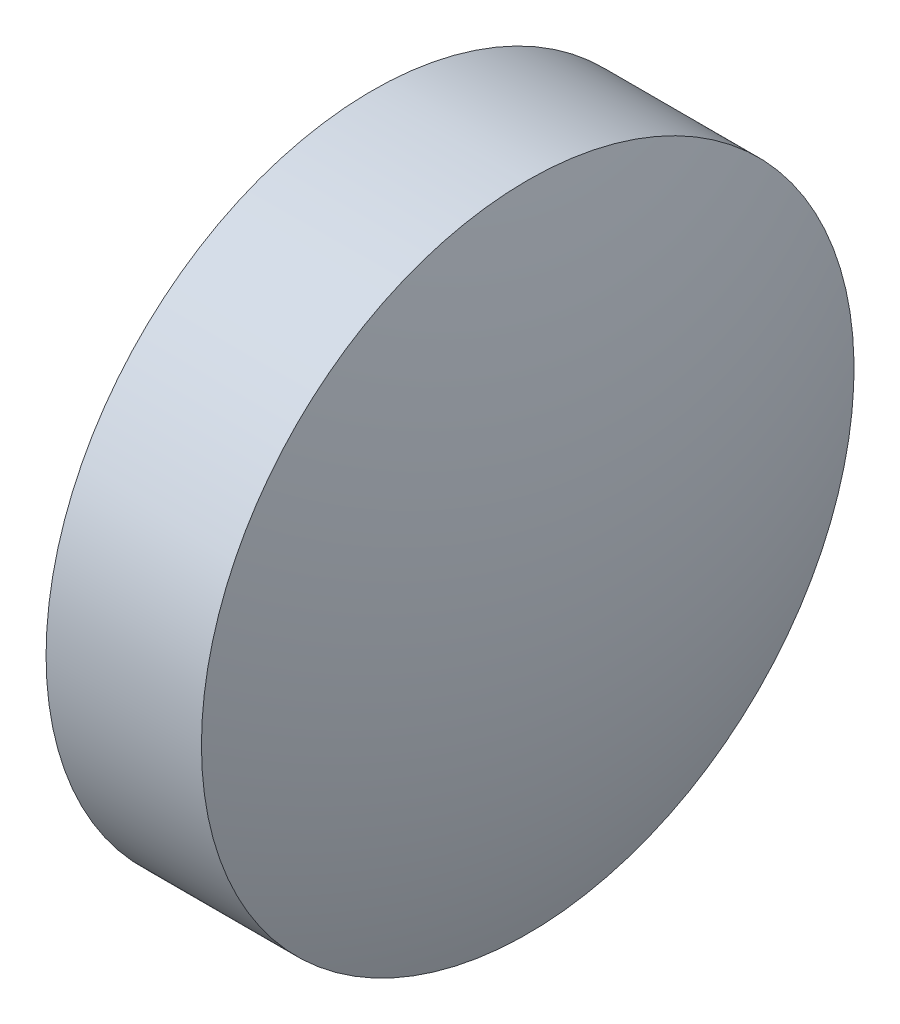
ISO-10303-21;
HEADER;
FILE_DESCRIPTION(('STEP AP214'),'2;1');
FILE_NAME('part.step','',(''),(''),'','','');
FILE_SCHEMA(('AUTOMOTIVE_DESIGN { 1 0 10303 214 1 1 1 1 }'));
ENDSEC;
DATA;
#1=APPLICATION_CONTEXT('core data for automotive mechanical design processes');
#2=APPLICATION_PROTOCOL_DEFINITION('international standard','automotive_design',2000,#1);
#3=PRODUCT_CONTEXT('',#1,'mechanical');
#4=PRODUCT('Part','Part','',(#3));
#5=PRODUCT_RELATED_PRODUCT_CATEGORY('part','',(#4));
#6=PRODUCT_DEFINITION_FORMATION('','',#4);
#7=PRODUCT_DEFINITION_CONTEXT('part definition',#1,'design');
#8=PRODUCT_DEFINITION('design','',#6,#7);
#9=PRODUCT_DEFINITION_SHAPE('','',#8);
#10=(LENGTH_UNIT() NAMED_UNIT(*) SI_UNIT(.MILLI.,.METRE.));
#11=(NAMED_UNIT(*) PLANE_ANGLE_UNIT() SI_UNIT($,.RADIAN.));
#12=(NAMED_UNIT(*) SI_UNIT($,.STERADIAN.) SOLID_ANGLE_UNIT());
#13=UNCERTAINTY_MEASURE_WITH_UNIT(LENGTH_MEASURE(1.E-05),#10,'distance_accuracy_value','');
#14=(GEOMETRIC_REPRESENTATION_CONTEXT(3) GLOBAL_UNCERTAINTY_ASSIGNED_CONTEXT((#13)) GLOBAL_UNIT_ASSIGNED_CONTEXT((#10,
#11,#12)) REPRESENTATION_CONTEXT('',''));
#15=CARTESIAN_POINT('',(0.,0.,0.));
#16=DIRECTION('',(0.,0.,1.));
#17=DIRECTION('',(1.,0.,0.));
#18=AXIS2_PLACEMENT_3D('',#15,#16,#17);
#19=CARTESIAN_POINT('',(430.840461144944,10.5563283383481,0.));
#20=DIRECTION('',(-1.,0.,0.));
#21=DIRECTION('',(0.,1.,0.));
#22=AXIS2_PLACEMENT_3D('',#19,#20,#21);
#23=SPHERICAL_SURFACE('',#22,9.13937500000006);
#24=CARTESIAN_POINT('',(439.419836144944,10.5563283383481,0.));
#25=DIRECTION('',(-1.,0.,0.));
#26=DIRECTION('',(0.,0.,1.));
#27=AXIS2_PLACEMENT_3D('',#24,#25,#26);
#28=CIRCLE('',#27,3.15);
#29=CARTESIAN_POINT('',(439.419836144944,10.5563283383481,3.15));
#30=VERTEX_POINT('',#29);
#31=EDGE_CURVE('E10',#30,#30,#28,.T.);
#32=ORIENTED_EDGE('',*,*,#31,.F.);
#33=EDGE_LOOP('',(#32));
#34=FACE_BOUND('',#33,.T.);
#35=ADVANCED_FACE('F35',(#34),#23,.T.);
#36=CARTESIAN_POINT('',(437.059198056195,10.5563283383481,0.));
#37=DIRECTION('',(-1.,0.,0.));
#38=DIRECTION('',(0.,0.,1.));
#39=AXIS2_PLACEMENT_3D('',#36,#37,#38);
#40=CYLINDRICAL_SURFACE('',#39,3.15);
#41=CARTESIAN_POINT('',(437.919836144944,10.5563283383481,0.));
#42=DIRECTION('',(-1.,0.,0.));
#43=DIRECTION('',(0.,0.,1.));
#44=AXIS2_PLACEMENT_3D('',#41,#42,#43);
#45=CIRCLE('',#44,3.15);
#46=CARTESIAN_POINT('',(437.919836144944,10.5563283383481,3.15));
#47=VERTEX_POINT('',#46);
#48=EDGE_CURVE('E41',#47,#47,#45,.T.);
#49=ORIENTED_EDGE('',*,*,#48,.F.);
#50=EDGE_LOOP('',(#49));
#51=FACE_BOUND('',#50,.T.);
#52=ORIENTED_EDGE('',*,*,#31,.T.);
#53=EDGE_LOOP('',(#52));
#54=FACE_BOUND('',#53,.T.);
#55=ADVANCED_FACE('F49',(#51,#54),#40,.T.);
#56=CARTESIAN_POINT('',(437.919836144944,10.5563283383481,0.));
#57=DIRECTION('',(1.,0.,0.));
#58=DIRECTION('',(0.,0.,-1.));
#59=AXIS2_PLACEMENT_3D('',#56,#57,#58);
#60=PLANE('',#59);
#61=ORIENTED_EDGE('',*,*,#48,.T.);
#62=EDGE_LOOP('',(#61));
#63=FACE_BOUND('',#62,.T.);
#64=ADVANCED_FACE('F47',(#63),#60,.F.);
#65=CLOSED_SHELL('',(#35,#55,#64));
#66=MANIFOLD_SOLID_BREP('B2',#65);
#67=ADVANCED_BREP_SHAPE_REPRESENTATION('',(#18,#66),#14);
#68=SHAPE_DEFINITION_REPRESENTATION(#9,#67);
ENDSEC;
END-ISO-10303-21;
